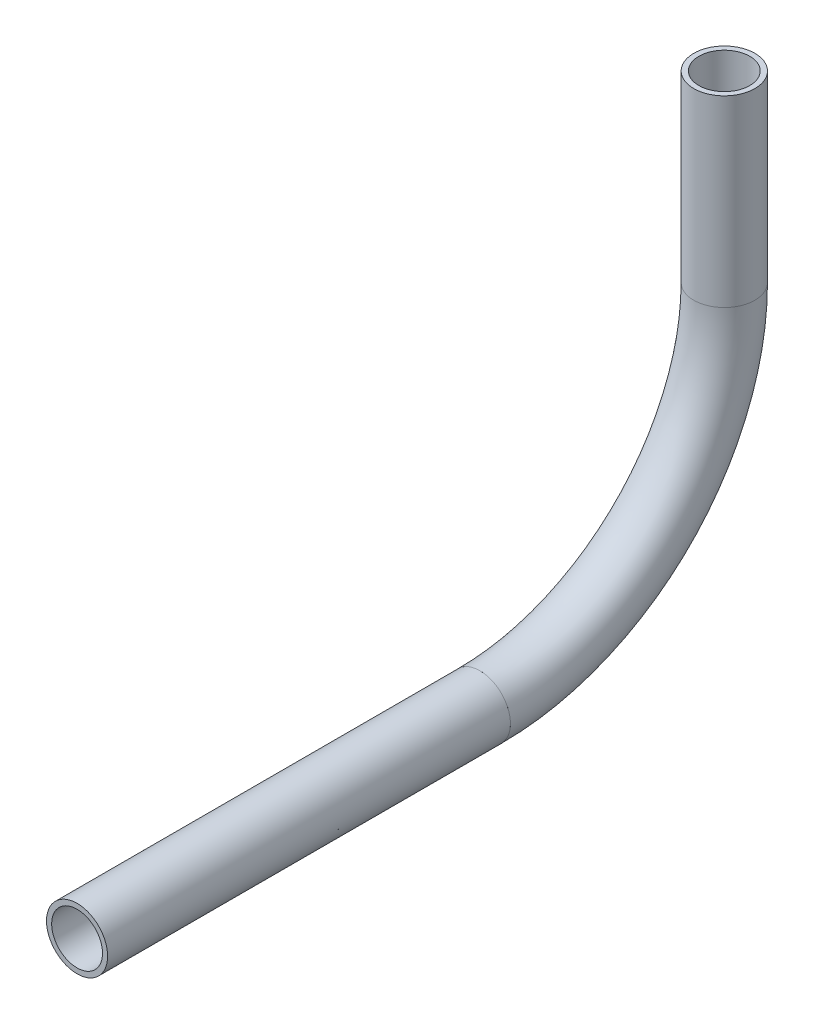
ISO-10303-21;
HEADER;
FILE_DESCRIPTION(('STEP AP214'),'2;1');
FILE_NAME('part.step','',(''),(''),'','','');
FILE_SCHEMA(('AUTOMOTIVE_DESIGN { 1 0 10303 214 1 1 1 1 }'));
ENDSEC;
DATA;
#1=APPLICATION_CONTEXT('core data for automotive mechanical design processes');
#2=APPLICATION_PROTOCOL_DEFINITION('international standard','automotive_design',2000,#1);
#3=PRODUCT_CONTEXT('',#1,'mechanical');
#4=PRODUCT('Part','Part','',(#3));
#5=PRODUCT_RELATED_PRODUCT_CATEGORY('part','',(#4));
#6=PRODUCT_DEFINITION_FORMATION('','',#4);
#7=PRODUCT_DEFINITION_CONTEXT('part definition',#1,'design');
#8=PRODUCT_DEFINITION('design','',#6,#7);
#9=PRODUCT_DEFINITION_SHAPE('','',#8);
#10=(LENGTH_UNIT() NAMED_UNIT(*) SI_UNIT(.MILLI.,.METRE.));
#11=(NAMED_UNIT(*) PLANE_ANGLE_UNIT() SI_UNIT($,.RADIAN.));
#12=(NAMED_UNIT(*) SI_UNIT($,.STERADIAN.) SOLID_ANGLE_UNIT());
#13=UNCERTAINTY_MEASURE_WITH_UNIT(LENGTH_MEASURE(1.E-05),#10,'distance_accuracy_value','');
#14=(GEOMETRIC_REPRESENTATION_CONTEXT(3) GLOBAL_UNCERTAINTY_ASSIGNED_CONTEXT((#13)) GLOBAL_UNIT_ASSIGNED_CONTEXT((#10,
#11,#12)) REPRESENTATION_CONTEXT('',''));
#15=CARTESIAN_POINT('',(0.,0.,0.));
#16=DIRECTION('',(0.,0.,1.));
#17=DIRECTION('',(1.,0.,0.));
#18=AXIS2_PLACEMENT_3D('',#15,#16,#17);
#19=CARTESIAN_POINT('',(0.,-229.260399282831,259.179579455468));
#20=DIRECTION('',(0.,1.,0.));
#21=DIRECTION('',(0.,0.,1.));
#22=AXIS2_PLACEMENT_3D('',#19,#20,#21);
#23=CYLINDRICAL_SURFACE('',#22,5.28319999999999);
#24=CARTESIAN_POINT('',(0.,-191.160399282831,259.179579455468));
#25=DIRECTION('',(0.,-1.,0.));
#26=DIRECTION('',(0.,0.,-1.));
#27=AXIS2_PLACEMENT_3D('',#24,#25,#26);
#28=CIRCLE('',#27,5.28319999999999);
#29=CARTESIAN_POINT('',(0.,-191.160399282831,253.896379455468));
#30=VERTEX_POINT('',#29);
#31=EDGE_CURVE('E55',#30,#30,#28,.T.);
#32=ORIENTED_EDGE('',*,*,#31,.F.);
#33=EDGE_LOOP('',(#32));
#34=FACE_BOUND('',#33,.T.);
#35=CARTESIAN_POINT('',(0.,-229.260399282831,259.179579455468));
#36=DIRECTION('',(0.,-1.,0.));
#37=DIRECTION('',(0.,0.,-1.));
#38=AXIS2_PLACEMENT_3D('',#35,#36,#37);
#39=CIRCLE('',#38,5.28319999999999);
#40=CARTESIAN_POINT('',(0.,-229.260399282831,253.896379455468));
#41=VERTEX_POINT('',#40);
#42=EDGE_CURVE('E51',#41,#41,#39,.T.);
#43=ORIENTED_EDGE('',*,*,#42,.T.);
#44=EDGE_LOOP('',(#43));
#45=FACE_BOUND('',#44,.T.);
#46=ADVANCED_FACE('F47',(#34,#45),#23,.F.);
#47=CARTESIAN_POINT('',(0.,-229.260399282831,259.179579455468));
#48=DIRECTION('',(0.,1.,0.));
#49=DIRECTION('',(0.,0.,1.));
#50=AXIS2_PLACEMENT_3D('',#47,#48,#49);
#51=CYLINDRICAL_SURFACE('',#50,6.35);
#52=CARTESIAN_POINT('',(0.,-191.160399282831,259.179579455468));
#53=DIRECTION('',(0.,-1.,0.));
#54=DIRECTION('',(0.,0.,-1.));
#55=AXIS2_PLACEMENT_3D('',#52,#53,#54);
#56=CIRCLE('',#55,6.35);
#57=CARTESIAN_POINT('',(0.,-191.160399282831,252.829579455468));
#58=VERTEX_POINT('',#57);
#59=EDGE_CURVE('E59',#58,#58,#56,.T.);
#60=ORIENTED_EDGE('',*,*,#59,.T.);
#61=EDGE_LOOP('',(#60));
#62=FACE_BOUND('',#61,.T.);
#63=CARTESIAN_POINT('',(0.,-229.260399282831,259.179579455468));
#64=DIRECTION('',(0.,-1.,0.));
#65=DIRECTION('',(0.,0.,-1.));
#66=AXIS2_PLACEMENT_3D('',#63,#64,#65);
#67=CIRCLE('',#66,6.35);
#68=CARTESIAN_POINT('',(0.,-229.260399282831,252.829579455468));
#69=VERTEX_POINT('',#68);
#70=EDGE_CURVE('E12',#69,#69,#67,.T.);
#71=ORIENTED_EDGE('',*,*,#70,.F.);
#72=EDGE_LOOP('',(#71));
#73=FACE_BOUND('',#72,.T.);
#74=ADVANCED_FACE('F74',(#62,#73),#51,.T.);
#75=CARTESIAN_POINT('',(0.,-191.160399282831,259.179579455468));
#76=DIRECTION('',(0.,-1.,0.));
#77=DIRECTION('',(0.,0.,-1.));
#78=AXIS2_PLACEMENT_3D('',#75,#76,#77);
#79=PLANE('',#78);
#80=ORIENTED_EDGE('',*,*,#31,.T.);
#81=EDGE_LOOP('',(#80));
#82=FACE_BOUND('',#81,.T.);
#83=ORIENTED_EDGE('',*,*,#59,.F.);
#84=EDGE_LOOP('',(#83));
#85=FACE_BOUND('',#84,.T.);
#86=ADVANCED_FACE('F70',(#82,#85),#79,.F.);
#87=CARTESIAN_POINT('',(0.,-229.260399282831,259.179579455468));
#88=DIRECTION('',(0.,-1.,0.));
#89=DIRECTION('',(0.,0.,-1.));
#90=AXIS2_PLACEMENT_3D('',#87,#88,#89);
#91=PLANE('',#90);
#92=ORIENTED_EDGE('',*,*,#42,.F.);
#93=EDGE_LOOP('',(#92));
#94=FACE_BOUND('',#93,.T.);
#95=ORIENTED_EDGE('',*,*,#70,.T.);
#96=EDGE_LOOP('',(#95));
#97=FACE_BOUND('',#96,.T.);
#98=ADVANCED_FACE('F49',(#94,#97),#91,.T.);
#99=CLOSED_SHELL('',(#46,#74,#86,#98));
#100=MANIFOLD_SOLID_BREP('B2',#99);
#101=CARTESIAN_POINT('',(0.,-229.260399282831,309.979579455468));
#102=DIRECTION('',(1.,0.,0.));
#103=DIRECTION('',(0.,0.,-1.));
#104=AXIS2_PLACEMENT_3D('',#101,#102,#103);
#105=TOROIDAL_SURFACE('',#104,50.8,5.28319999999999);
#106=CARTESIAN_POINT('',(0.,-280.060399282831,309.979579455468));
#107=DIRECTION('',(0.,0.,1.));
#108=DIRECTION('',(0.,-1.,0.));
#109=AXIS2_PLACEMENT_3D('',#106,#107,#108);
#110=CIRCLE('',#109,5.28319999999999);
#111=CARTESIAN_POINT('',(0.,-285.343599282831,309.979579455468));
#112=VERTEX_POINT('',#111);
#113=EDGE_CURVE('E150',#112,#112,#110,.T.);
#114=CARTESIAN_POINT('',(0.,-229.260399282831,259.179579455468));
#115=DIRECTION('',(0.,1.,0.));
#116=DIRECTION('',(0.,0.,1.));
#117=AXIS2_PLACEMENT_3D('',#114,#115,#116);
#118=CIRCLE('',#117,5.28319999999999);
#119=CARTESIAN_POINT('',(0.,-229.260399282831,253.896379455468));
#120=VERTEX_POINT('',#119);
#121=EDGE_CURVE('E140',#120,#120,#118,.T.);
#122=CARTESIAN_POINT('',(0.,-229.260399282831,309.979579455468));
#123=DIRECTION('',(1.,0.,0.));
#124=DIRECTION('',(0.,0.,-1.));
#125=AXIS2_PLACEMENT_3D('',#122,#123,#124);
#126=CIRCLE('',#125,56.0832);
#127=EDGE_CURVE('',#112,#120,#126,.T.);
#128=ORIENTED_EDGE('',*,*,#113,.T.);
#129=ORIENTED_EDGE('',*,*,#121,.T.);
#130=ORIENTED_EDGE('',*,*,#127,.T.);
#131=ORIENTED_EDGE('',*,*,#127,.F.);
#132=EDGE_LOOP('',(#128,#130,#129,#131));
#133=FACE_BOUND('',#132,.T.);
#134=ADVANCED_FACE('F136',(#133),#105,.F.);
#135=CARTESIAN_POINT('',(0.,-229.260399282831,309.979579455468));
#136=DIRECTION('',(1.,0.,0.));
#137=DIRECTION('',(0.,0.,-1.));
#138=AXIS2_PLACEMENT_3D('',#135,#136,#137);
#139=TOROIDAL_SURFACE('',#138,50.8,6.35);
#140=CARTESIAN_POINT('',(0.,-280.060399282831,309.979579455468));
#141=DIRECTION('',(0.,0.,1.));
#142=DIRECTION('',(0.,-1.,0.));
#143=AXIS2_PLACEMENT_3D('',#140,#141,#142);
#144=CIRCLE('',#143,6.35);
#145=CARTESIAN_POINT('',(0.,-286.410399282831,309.979579455468));
#146=VERTEX_POINT('',#145);
#147=EDGE_CURVE('E144',#146,#146,#144,.T.);
#148=CARTESIAN_POINT('',(0.,-229.260399282831,259.179579455468));
#149=DIRECTION('',(0.,1.,0.));
#150=DIRECTION('',(0.,0.,1.));
#151=AXIS2_PLACEMENT_3D('',#148,#149,#150);
#152=CIRCLE('',#151,6.35);
#153=CARTESIAN_POINT('',(0.,-229.260399282831,252.829579455468));
#154=VERTEX_POINT('',#153);
#155=EDGE_CURVE('E46',#154,#154,#152,.T.);
#156=CARTESIAN_POINT('',(0.,-229.260399282831,309.979579455468));
#157=DIRECTION('',(1.,0.,0.));
#158=DIRECTION('',(0.,0.,-1.));
#159=AXIS2_PLACEMENT_3D('',#156,#157,#158);
#160=CIRCLE('',#159,57.15);
#161=EDGE_CURVE('',#146,#154,#160,.T.);
#162=ORIENTED_EDGE('',*,*,#147,.F.);
#163=ORIENTED_EDGE('',*,*,#155,.F.);
#164=ORIENTED_EDGE('',*,*,#161,.T.);
#165=ORIENTED_EDGE('',*,*,#161,.F.);
#166=EDGE_LOOP('',(#162,#164,#163,#165));
#167=FACE_BOUND('',#166,.T.);
#168=ADVANCED_FACE('F163',(#167),#139,.T.);
#169=CARTESIAN_POINT('',(0.,-280.060399282831,309.979579455468));
#170=DIRECTION('',(0.,0.,1.));
#171=DIRECTION('',(0.,-1.,0.));
#172=AXIS2_PLACEMENT_3D('',#169,#170,#171);
#173=PLANE('',#172);
#174=ORIENTED_EDGE('',*,*,#113,.F.);
#175=EDGE_LOOP('',(#174));
#176=FACE_BOUND('',#175,.T.);
#177=ORIENTED_EDGE('',*,*,#147,.T.);
#178=EDGE_LOOP('',(#177));
#179=FACE_BOUND('',#178,.T.);
#180=ADVANCED_FACE('F159',(#176,#179),#173,.T.);
#181=CARTESIAN_POINT('',(0.,-229.260399282831,259.179579455468));
#182=DIRECTION('',(0.,1.,0.));
#183=DIRECTION('',(0.,0.,1.));
#184=AXIS2_PLACEMENT_3D('',#181,#182,#183);
#185=PLANE('',#184);
#186=ORIENTED_EDGE('',*,*,#121,.F.);
#187=EDGE_LOOP('',(#186));
#188=FACE_BOUND('',#187,.T.);
#189=ORIENTED_EDGE('',*,*,#155,.T.);
#190=EDGE_LOOP('',(#189));
#191=FACE_BOUND('',#190,.T.);
#192=ADVANCED_FACE('F138',(#188,#191),#185,.T.);
#193=CLOSED_SHELL('',(#134,#168,#180,#192));
#194=MANIFOLD_SOLID_BREP('B7',#193);
#195=CARTESIAN_POINT('',(0.,-280.060399282831,393.690732942281));
#196=DIRECTION('',(0.,0.,-1.));
#197=DIRECTION('',(-1.,0.,0.));
#198=AXIS2_PLACEMENT_3D('',#195,#196,#197);
#199=CYLINDRICAL_SURFACE('',#198,5.28319999999999);
#200=CARTESIAN_POINT('',(0.,-280.060399282831,393.690732942281));
#201=DIRECTION('',(0.,0.,1.));
#202=DIRECTION('',(0.,-1.,0.));
#203=AXIS2_PLACEMENT_3D('',#200,#201,#202);
#204=CIRCLE('',#203,5.28319999999999);
#205=CARTESIAN_POINT('',(0.,-285.343599282831,393.690732942281));
#206=VERTEX_POINT('',#205);
#207=EDGE_CURVE('E234',#206,#206,#204,.T.);
#208=ORIENTED_EDGE('',*,*,#207,.T.);
#209=EDGE_LOOP('',(#208));
#210=FACE_BOUND('',#209,.T.);
#211=CARTESIAN_POINT('',(0.,-280.060399282831,309.979579455468));
#212=DIRECTION('',(0.,0.,-1.));
#213=DIRECTION('',(0.,1.,0.));
#214=AXIS2_PLACEMENT_3D('',#211,#212,#213);
#215=CIRCLE('',#214,5.28319999999999);
#216=CARTESIAN_POINT('',(0.,-274.777199282831,309.979579455468));
#217=VERTEX_POINT('',#216);
#218=EDGE_CURVE('E224',#217,#217,#215,.T.);
#219=ORIENTED_EDGE('',*,*,#218,.T.);
#220=EDGE_LOOP('',(#219));
#221=FACE_BOUND('',#220,.T.);
#222=ADVANCED_FACE('F220',(#210,#221),#199,.F.);
#223=CARTESIAN_POINT('',(0.,-280.060399282831,393.690732942281));
#224=DIRECTION('',(0.,0.,-1.));
#225=DIRECTION('',(-1.,0.,0.));
#226=AXIS2_PLACEMENT_3D('',#223,#224,#225);
#227=CYLINDRICAL_SURFACE('',#226,6.35);
#228=CARTESIAN_POINT('',(0.,-280.060399282831,393.690732942281));
#229=DIRECTION('',(0.,0.,1.));
#230=DIRECTION('',(0.,-1.,0.));
#231=AXIS2_PLACEMENT_3D('',#228,#229,#230);
#232=CIRCLE('',#231,6.35);
#233=CARTESIAN_POINT('',(0.,-286.410399282831,393.690732942281));
#234=VERTEX_POINT('',#233);
#235=EDGE_CURVE('E228',#234,#234,#232,.T.);
#236=ORIENTED_EDGE('',*,*,#235,.F.);
#237=EDGE_LOOP('',(#236));
#238=FACE_BOUND('',#237,.T.);
#239=CARTESIAN_POINT('',(0.,-280.060399282831,309.979579455468));
#240=DIRECTION('',(0.,0.,-1.));
#241=DIRECTION('',(0.,1.,0.));
#242=AXIS2_PLACEMENT_3D('',#239,#240,#241);
#243=CIRCLE('',#242,6.35);
#244=CARTESIAN_POINT('',(0.,-273.710399282831,309.979579455468));
#245=VERTEX_POINT('',#244);
#246=EDGE_CURVE('E135',#245,#245,#243,.T.);
#247=ORIENTED_EDGE('',*,*,#246,.F.);
#248=EDGE_LOOP('',(#247));
#249=FACE_BOUND('',#248,.T.);
#250=ADVANCED_FACE('F247',(#238,#249),#227,.T.);
#251=CARTESIAN_POINT('',(0.,-280.060399282831,393.690732942281));
#252=DIRECTION('',(0.,0.,1.));
#253=DIRECTION('',(0.,-1.,0.));
#254=AXIS2_PLACEMENT_3D('',#251,#252,#253);
#255=PLANE('',#254);
#256=ORIENTED_EDGE('',*,*,#207,.F.);
#257=EDGE_LOOP('',(#256));
#258=FACE_BOUND('',#257,.T.);
#259=ORIENTED_EDGE('',*,*,#235,.T.);
#260=EDGE_LOOP('',(#259));
#261=FACE_BOUND('',#260,.T.);
#262=ADVANCED_FACE('F243',(#258,#261),#255,.T.);
#263=CARTESIAN_POINT('',(0.,-280.060399282831,309.979579455468));
#264=DIRECTION('',(0.,0.,-1.));
#265=DIRECTION('',(0.,1.,0.));
#266=AXIS2_PLACEMENT_3D('',#263,#264,#265);
#267=PLANE('',#266);
#268=ORIENTED_EDGE('',*,*,#218,.F.);
#269=EDGE_LOOP('',(#268));
#270=FACE_BOUND('',#269,.T.);
#271=ORIENTED_EDGE('',*,*,#246,.T.);
#272=EDGE_LOOP('',(#271));
#273=FACE_BOUND('',#272,.T.);
#274=ADVANCED_FACE('F222',(#270,#273),#267,.T.);
#275=CLOSED_SHELL('',(#222,#250,#262,#274));
#276=MANIFOLD_SOLID_BREP('B41',#275);
#277=ADVANCED_BREP_SHAPE_REPRESENTATION('',(#18,#100,#194,#276),#14);
#278=SHAPE_DEFINITION_REPRESENTATION(#9,#277);
ENDSEC;
END-ISO-10303-21;
